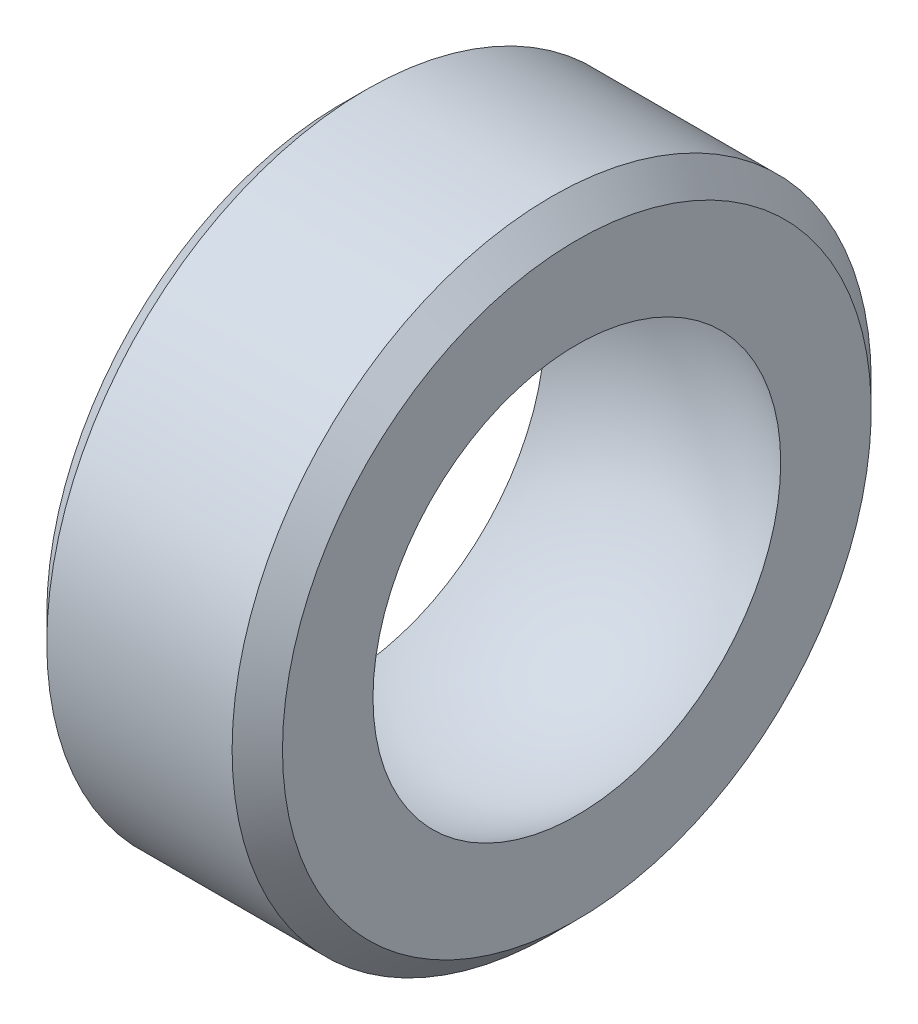
ISO-10303-21;
HEADER;
FILE_DESCRIPTION(('STEP AP214'),'2;1');
FILE_NAME('part.step','',(''),(''),'','','');
FILE_SCHEMA(('AUTOMOTIVE_DESIGN { 1 0 10303 214 1 1 1 1 }'));
ENDSEC;
DATA;
#1=APPLICATION_CONTEXT('core data for automotive mechanical design processes');
#2=APPLICATION_PROTOCOL_DEFINITION('international standard','automotive_design',2000,#1);
#3=PRODUCT_CONTEXT('',#1,'mechanical');
#4=PRODUCT('Part','Part','',(#3));
#5=PRODUCT_RELATED_PRODUCT_CATEGORY('part','',(#4));
#6=PRODUCT_DEFINITION_FORMATION('','',#4);
#7=PRODUCT_DEFINITION_CONTEXT('part definition',#1,'design');
#8=PRODUCT_DEFINITION('design','',#6,#7);
#9=PRODUCT_DEFINITION_SHAPE('','',#8);
#10=(LENGTH_UNIT() NAMED_UNIT(*) SI_UNIT(.MILLI.,.METRE.));
#11=(NAMED_UNIT(*) PLANE_ANGLE_UNIT() SI_UNIT($,.RADIAN.));
#12=(NAMED_UNIT(*) SI_UNIT($,.STERADIAN.) SOLID_ANGLE_UNIT());
#13=UNCERTAINTY_MEASURE_WITH_UNIT(LENGTH_MEASURE(1.E-05),#10,'distance_accuracy_value','');
#14=(GEOMETRIC_REPRESENTATION_CONTEXT(3) GLOBAL_UNCERTAINTY_ASSIGNED_CONTEXT((#13)) GLOBAL_UNIT_ASSIGNED_CONTEXT((#10,
#11,#12)) REPRESENTATION_CONTEXT('',''));
#15=CARTESIAN_POINT('',(0.,0.,0.));
#16=DIRECTION('',(0.,0.,1.));
#17=DIRECTION('',(1.,0.,0.));
#18=AXIS2_PLACEMENT_3D('',#15,#16,#17);
#19=CARTESIAN_POINT('',(0.,0.,0.));
#20=DIRECTION('',(-1.,0.,0.));
#21=DIRECTION('',(0.,1.,0.));
#22=AXIS2_PLACEMENT_3D('',#19,#20,#21);
#23=SPHERICAL_SURFACE('',#22,7.10355720748415);
#24=CARTESIAN_POINT('',(3.555,0.,0.));
#25=DIRECTION('',(-1.,0.,0.));
#26=DIRECTION('',(0.,0.,1.));
#27=AXIS2_PLACEMENT_3D('',#24,#25,#26);
#28=CIRCLE('',#27,6.15);
#29=CARTESIAN_POINT('',(3.555,0.,6.15));
#30=VERTEX_POINT('',#29);
#31=EDGE_CURVE('E53',#30,#30,#28,.T.);
#32=ORIENTED_EDGE('',*,*,#31,.F.);
#33=EDGE_LOOP('',(#32));
#34=FACE_BOUND('',#33,.T.);
#35=CARTESIAN_POINT('',(-3.555,0.,0.));
#36=DIRECTION('',(-1.,0.,0.));
#37=DIRECTION('',(0.,0.,1.));
#38=AXIS2_PLACEMENT_3D('',#35,#36,#37);
#39=CIRCLE('',#38,6.15);
#40=CARTESIAN_POINT('',(-3.555,0.,6.15));
#41=VERTEX_POINT('',#40);
#42=EDGE_CURVE('E10',#41,#41,#39,.T.);
#43=ORIENTED_EDGE('',*,*,#42,.T.);
#44=EDGE_LOOP('',(#43));
#45=FACE_BOUND('',#44,.T.);
#46=ADVANCED_FACE('F31',(#34,#45),#23,.F.);
#47=CARTESIAN_POINT('',(-3.555,6.15,0.));
#48=DIRECTION('',(1.,0.,0.));
#49=DIRECTION('',(0.,0.,-1.));
#50=AXIS2_PLACEMENT_3D('',#47,#48,#49);
#51=PLANE('',#50);
#52=ORIENTED_EDGE('',*,*,#42,.F.);
#53=EDGE_LOOP('',(#52));
#54=FACE_BOUND('',#53,.T.);
#55=CARTESIAN_POINT('',(-3.555,0.,0.));
#56=DIRECTION('',(-1.,0.,0.));
#57=DIRECTION('',(0.,0.,1.));
#58=AXIS2_PLACEMENT_3D('',#55,#56,#57);
#59=CIRCLE('',#58,8.88);
#60=CARTESIAN_POINT('',(-3.555,0.,8.88));
#61=VERTEX_POINT('',#60);
#62=EDGE_CURVE('E37',#61,#61,#59,.T.);
#63=ORIENTED_EDGE('',*,*,#62,.T.);
#64=EDGE_LOOP('',(#63));
#65=FACE_BOUND('',#64,.T.);
#66=ADVANCED_FACE('F60',(#54,#65),#51,.F.);
#67=CARTESIAN_POINT('',(-2.795,0.,0.));
#68=DIRECTION('',(1.,0.,0.));
#69=DIRECTION('',(0.,0.,-1.));
#70=AXIS2_PLACEMENT_3D('',#67,#68,#69);
#71=CONICAL_SURFACE('',#70,9.64,0.785398163397449);
#72=ORIENTED_EDGE('',*,*,#62,.F.);
#73=EDGE_LOOP('',(#72));
#74=FACE_BOUND('',#73,.T.);
#75=CARTESIAN_POINT('',(-2.795,0.,0.));
#76=DIRECTION('',(-1.,0.,0.));
#77=DIRECTION('',(0.,0.,1.));
#78=AXIS2_PLACEMENT_3D('',#75,#76,#77);
#79=CIRCLE('',#78,9.64);
#80=CARTESIAN_POINT('',(-2.795,0.,9.64));
#81=VERTEX_POINT('',#80);
#82=EDGE_CURVE('E41',#81,#81,#79,.T.);
#83=ORIENTED_EDGE('',*,*,#82,.T.);
#84=EDGE_LOOP('',(#83));
#85=FACE_BOUND('',#84,.T.);
#86=ADVANCED_FACE('F64',(#74,#85),#71,.T.);
#87=CARTESIAN_POINT('',(-3.555,0.,0.));
#88=DIRECTION('',(-1.,0.,0.));
#89=DIRECTION('',(0.,0.,1.));
#90=AXIS2_PLACEMENT_3D('',#87,#88,#89);
#91=CYLINDRICAL_SURFACE('',#90,9.64);
#92=ORIENTED_EDGE('',*,*,#82,.F.);
#93=EDGE_LOOP('',(#92));
#94=FACE_BOUND('',#93,.T.);
#95=CARTESIAN_POINT('',(2.795,0.,0.));
#96=DIRECTION('',(-1.,0.,0.));
#97=DIRECTION('',(0.,0.,1.));
#98=AXIS2_PLACEMENT_3D('',#95,#96,#97);
#99=CIRCLE('',#98,9.64);
#100=CARTESIAN_POINT('',(2.795,0.,9.64));
#101=VERTEX_POINT('',#100);
#102=EDGE_CURVE('E45',#101,#101,#99,.T.);
#103=ORIENTED_EDGE('',*,*,#102,.T.);
#104=EDGE_LOOP('',(#103));
#105=FACE_BOUND('',#104,.T.);
#106=ADVANCED_FACE('F69',(#94,#105),#91,.T.);
#107=CARTESIAN_POINT('',(3.555,0.,0.));
#108=DIRECTION('',(-1.,0.,0.));
#109=DIRECTION('',(0.,0.,1.));
#110=AXIS2_PLACEMENT_3D('',#107,#108,#109);
#111=CONICAL_SURFACE('',#110,8.88,0.785398163397449);
#112=ORIENTED_EDGE('',*,*,#102,.F.);
#113=EDGE_LOOP('',(#112));
#114=FACE_BOUND('',#113,.T.);
#115=CARTESIAN_POINT('',(3.555,0.,0.));
#116=DIRECTION('',(-1.,0.,0.));
#117=DIRECTION('',(0.,0.,1.));
#118=AXIS2_PLACEMENT_3D('',#115,#116,#117);
#119=CIRCLE('',#118,8.88);
#120=CARTESIAN_POINT('',(3.555,0.,8.88));
#121=VERTEX_POINT('',#120);
#122=EDGE_CURVE('E50',#121,#121,#119,.T.);
#123=ORIENTED_EDGE('',*,*,#122,.T.);
#124=EDGE_LOOP('',(#123));
#125=FACE_BOUND('',#124,.T.);
#126=ADVANCED_FACE('F75',(#114,#125),#111,.T.);
#127=CARTESIAN_POINT('',(3.555,8.88,0.));
#128=DIRECTION('',(-1.,0.,0.));
#129=DIRECTION('',(0.,0.,1.));
#130=AXIS2_PLACEMENT_3D('',#127,#128,#129);
#131=PLANE('',#130);
#132=ORIENTED_EDGE('',*,*,#122,.F.);
#133=EDGE_LOOP('',(#132));
#134=FACE_BOUND('',#133,.T.);
#135=ORIENTED_EDGE('',*,*,#31,.T.);
#136=EDGE_LOOP('',(#135));
#137=FACE_BOUND('',#136,.T.);
#138=ADVANCED_FACE('F57',(#134,#137),#131,.F.);
#139=CLOSED_SHELL('',(#46,#66,#86,#106,#126,#138));
#140=MANIFOLD_SOLID_BREP('B2',#139);
#141=ADVANCED_BREP_SHAPE_REPRESENTATION('',(#18,#140),#14);
#142=SHAPE_DEFINITION_REPRESENTATION(#9,#141);
ENDSEC;
END-ISO-10303-21;
